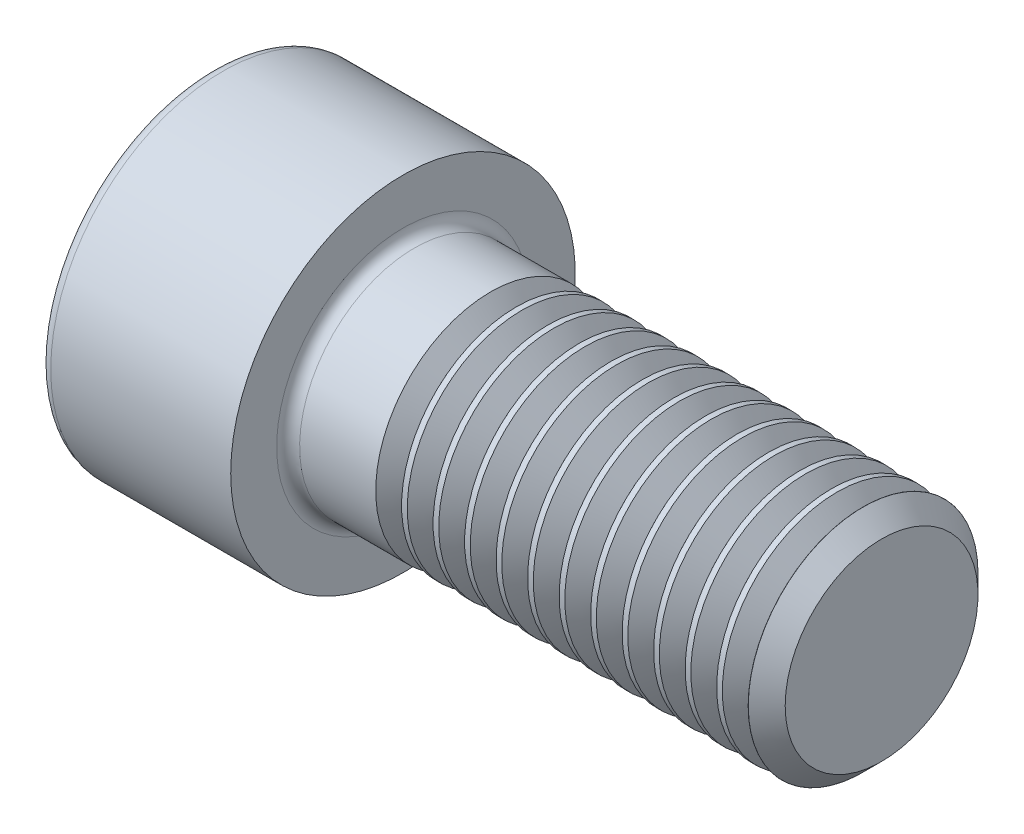
ISO-10303-21;
HEADER;
FILE_DESCRIPTION(('STEP AP214'),'2;1');
FILE_NAME('part.step','',(''),(''),'','','');
FILE_SCHEMA(('AUTOMOTIVE_DESIGN { 1 0 10303 214 1 1 1 1 }'));
ENDSEC;
DATA;
#1=APPLICATION_CONTEXT('core data for automotive mechanical design processes');
#2=APPLICATION_PROTOCOL_DEFINITION('international standard','automotive_design',2000,#1);
#3=PRODUCT_CONTEXT('',#1,'mechanical');
#4=PRODUCT('Part','Part','',(#3));
#5=PRODUCT_RELATED_PRODUCT_CATEGORY('part','',(#4));
#6=PRODUCT_DEFINITION_FORMATION('','',#4);
#7=PRODUCT_DEFINITION_CONTEXT('part definition',#1,'design');
#8=PRODUCT_DEFINITION('design','',#6,#7);
#9=PRODUCT_DEFINITION_SHAPE('','',#8);
#10=(LENGTH_UNIT() NAMED_UNIT(*) SI_UNIT(.MILLI.,.METRE.));
#11=(NAMED_UNIT(*) PLANE_ANGLE_UNIT() SI_UNIT($,.RADIAN.));
#12=(NAMED_UNIT(*) SI_UNIT($,.STERADIAN.) SOLID_ANGLE_UNIT());
#13=UNCERTAINTY_MEASURE_WITH_UNIT(LENGTH_MEASURE(1.E-05),#10,'distance_accuracy_value','');
#14=(GEOMETRIC_REPRESENTATION_CONTEXT(3) GLOBAL_UNCERTAINTY_ASSIGNED_CONTEXT((#13)) GLOBAL_UNIT_ASSIGNED_CONTEXT((#10,
#11,#12)) REPRESENTATION_CONTEXT('',''));
#15=CARTESIAN_POINT('',(0.,0.,0.));
#16=DIRECTION('',(0.,0.,1.));
#17=DIRECTION('',(1.,0.,0.));
#18=AXIS2_PLACEMENT_3D('',#15,#16,#17);
#19=CARTESIAN_POINT('',(0.,0.,0.));
#20=DIRECTION('',(-1.,0.,0.));
#21=DIRECTION('',(0.,0.,1.));
#22=AXIS2_PLACEMENT_3D('',#19,#20,#21);
#23=PLANE('',#22);
#24=DIRECTION('',(0.,-0.499999999999999,0.866025403784439));
#25=VECTOR('',#24,1.);
#26=CARTESIAN_POINT('',(0.,5.83989797285307,0.));
#27=LINE('',#26,#25);
#28=CARTESIAN_POINT('',(0.,5.83989797285307,0.));
#29=VERTEX_POINT('',#28);
#30=CARTESIAN_POINT('',(0.,2.91994898642654,5.0575));
#31=VERTEX_POINT('',#30);
#32=EDGE_CURVE('E448',#29,#31,#27,.T.);
#33=ORIENTED_EDGE('',*,*,#32,.T.);
#34=DIRECTION('',(0.,1.,0.));
#35=VECTOR('',#34,1.);
#36=CARTESIAN_POINT('',(0.,-2.91994898642653,5.0575));
#37=LINE('',#36,#35);
#38=CARTESIAN_POINT('',(0.,-2.91994898642653,5.0575));
#39=VERTEX_POINT('',#38);
#40=EDGE_CURVE('E135',#39,#31,#37,.T.);
#41=ORIENTED_EDGE('',*,*,#40,.F.);
#42=DIRECTION('',(0.,-0.500000000000001,-0.866025403784438));
#43=VECTOR('',#42,1.);
#44=CARTESIAN_POINT('',(0.,-2.91994898642653,5.0575));
#45=LINE('',#44,#43);
#46=CARTESIAN_POINT('',(0.,-5.83989797285306,0.));
#47=VERTEX_POINT('',#46);
#48=EDGE_CURVE('E467',#39,#47,#45,.T.);
#49=ORIENTED_EDGE('',*,*,#48,.T.);
#50=DIRECTION('',(0.,0.499999999999999,-0.866025403784439));
#51=VECTOR('',#50,1.);
#52=CARTESIAN_POINT('',(0.,-5.83989797285306,0.));
#53=LINE('',#52,#51);
#54=CARTESIAN_POINT('',(0.,-2.91994898642654,-5.0575));
#55=VERTEX_POINT('',#54);
#56=EDGE_CURVE('E470',#47,#55,#53,.T.);
#57=ORIENTED_EDGE('',*,*,#56,.T.);
#58=DIRECTION('',(0.,-1.,0.));
#59=VECTOR('',#58,1.);
#60=CARTESIAN_POINT('',(0.,2.91994898642653,-5.0575));
#61=LINE('',#60,#59);
#62=CARTESIAN_POINT('',(0.,2.91994898642653,-5.0575));
#63=VERTEX_POINT('',#62);
#64=EDGE_CURVE('E473',#63,#55,#61,.T.);
#65=ORIENTED_EDGE('',*,*,#64,.F.);
#66=DIRECTION('',(0.,-0.500000000000001,-0.866025403784438));
#67=VECTOR('',#66,1.);
#68=CARTESIAN_POINT('',(0.,5.83989797285307,0.));
#69=LINE('',#68,#67);
#70=EDGE_CURVE('E130',#29,#63,#69,.T.);
#71=ORIENTED_EDGE('',*,*,#70,.F.);
#72=EDGE_LOOP('',(#33,#41,#49,#57,#65,#71));
#73=FACE_BOUND('',#72,.T.);
#74=CARTESIAN_POINT('',(0.,0.,0.));
#75=DIRECTION('',(-1.,0.,0.));
#76=DIRECTION('',(0.,0.,1.));
#77=AXIS2_PLACEMENT_3D('',#74,#75,#76);
#78=CIRCLE('',#77,8.4);
#79=CARTESIAN_POINT('',(0.,0.,8.4));
#80=VERTEX_POINT('',#79);
#81=EDGE_CURVE('E47',#80,#80,#78,.T.);
#82=ORIENTED_EDGE('',*,*,#81,.T.);
#83=EDGE_LOOP('',(#82));
#84=FACE_BOUND('',#83,.T.);
#85=ADVANCED_FACE('F39',(#73,#84),#23,.T.);
#86=CARTESIAN_POINT('',(-31.75,0.,0.));
#87=DIRECTION('',(-1.,0.,0.));
#88=DIRECTION('',(0.,0.,1.));
#89=AXIS2_PLACEMENT_3D('',#86,#87,#88);
#90=CYLINDRICAL_SURFACE('',#89,9.);
#91=CARTESIAN_POINT('',(0.600000000000003,0.,0.));
#92=DIRECTION('',(-1.,0.,0.));
#93=DIRECTION('',(0.,0.,1.));
#94=AXIS2_PLACEMENT_3D('',#91,#92,#93);
#95=CIRCLE('',#94,9.);
#96=CARTESIAN_POINT('',(0.600000000000003,0.,9.));
#97=VERTEX_POINT('',#96);
#98=EDGE_CURVE('E11',#97,#97,#95,.F.);
#99=ORIENTED_EDGE('',*,*,#98,.T.);
#100=EDGE_LOOP('',(#99));
#101=FACE_BOUND('',#100,.T.);
#102=CARTESIAN_POINT('',(9.99999999999999,0.,0.));
#103=DIRECTION('',(-1.,0.,0.));
#104=DIRECTION('',(0.,0.,1.));
#105=AXIS2_PLACEMENT_3D('',#102,#103,#104);
#106=CIRCLE('',#105,9.);
#107=CARTESIAN_POINT('',(9.99999999999999,0.,9.));
#108=VERTEX_POINT('',#107);
#109=EDGE_CURVE('E153',#108,#108,#106,.T.);
#110=ORIENTED_EDGE('',*,*,#109,.T.);
#111=EDGE_LOOP('',(#110));
#112=FACE_BOUND('',#111,.T.);
#113=ADVANCED_FACE('F177',(#101,#112),#90,.T.);
#114=CARTESIAN_POINT('',(10.,9.,0.));
#115=DIRECTION('',(1.,0.,0.));
#116=DIRECTION('',(0.,0.,-1.));
#117=AXIS2_PLACEMENT_3D('',#114,#115,#116);
#118=PLANE('',#117);
#119=CARTESIAN_POINT('',(10.,0.,0.));
#120=DIRECTION('',(1.,0.,0.));
#121=DIRECTION('',(0.,0.,-1.));
#122=AXIS2_PLACEMENT_3D('',#119,#120,#121);
#123=CIRCLE('',#122,6.6);
#124=CARTESIAN_POINT('',(10.,0.,-6.6));
#125=VERTEX_POINT('',#124);
#126=EDGE_CURVE('E156',#125,#125,#123,.F.);
#127=ORIENTED_EDGE('',*,*,#126,.T.);
#128=EDGE_LOOP('',(#127));
#129=FACE_BOUND('',#128,.T.);
#130=ORIENTED_EDGE('',*,*,#109,.F.);
#131=EDGE_LOOP('',(#130));
#132=FACE_BOUND('',#131,.T.);
#133=ADVANCED_FACE('F183',(#129,#132),#118,.T.);
#134=CARTESIAN_POINT('',(-31.75,0.,0.));
#135=DIRECTION('',(-1.,0.,0.));
#136=DIRECTION('',(0.,0.,1.));
#137=AXIS2_PLACEMENT_3D('',#134,#135,#136);
#138=CYLINDRICAL_SURFACE('',#137,6.);
#139=CARTESIAN_POINT('',(14.5749999331658,0.,0.));
#140=DIRECTION('',(-1.,0.,0.));
#141=DIRECTION('',(0.,-1.,0.));
#142=AXIS2_PLACEMENT_3D('',#139,#140,#141);
#143=CIRCLE('',#142,6.);
#144=CARTESIAN_POINT('',(14.5749999331658,-6.,0.));
#145=VERTEX_POINT('',#144);
#146=EDGE_CURVE('E443',#145,#145,#143,.T.);
#147=ORIENTED_EDGE('',*,*,#146,.T.);
#148=EDGE_LOOP('',(#147));
#149=FACE_BOUND('',#148,.T.);
#150=CARTESIAN_POINT('',(10.6,0.,0.));
#151=DIRECTION('',(1.,0.,0.));
#152=DIRECTION('',(0.,0.,-1.));
#153=AXIS2_PLACEMENT_3D('',#150,#151,#152);
#154=CIRCLE('',#153,6.);
#155=CARTESIAN_POINT('',(10.6,0.,-6.));
#156=VERTEX_POINT('',#155);
#157=EDGE_CURVE('E159',#156,#156,#154,.T.);
#158=ORIENTED_EDGE('',*,*,#157,.T.);
#159=EDGE_LOOP('',(#158));
#160=FACE_BOUND('',#159,.T.);
#161=ADVANCED_FACE('F173',(#149,#160),#138,.T.);
#162=CARTESIAN_POINT('',(10.6,0.,0.));
#163=DIRECTION('',(1.,0.,0.));
#164=DIRECTION('',(0.,0.,-1.));
#165=AXIS2_PLACEMENT_3D('',#162,#163,#164);
#166=TOROIDAL_SURFACE('',#165,6.6,0.6);
#167=ORIENTED_EDGE('',*,*,#157,.F.);
#168=EDGE_LOOP('',(#167));
#169=FACE_BOUND('',#168,.T.);
#170=ORIENTED_EDGE('',*,*,#126,.F.);
#171=EDGE_LOOP('',(#170));
#172=FACE_BOUND('',#171,.T.);
#173=ADVANCED_FACE('F166',(#169,#172),#166,.F.);
#174=CARTESIAN_POINT('',(0.600000000000003,0.,0.));
#175=DIRECTION('',(-1.,0.,0.));
#176=DIRECTION('',(0.,0.,1.));
#177=AXIS2_PLACEMENT_3D('',#174,#175,#176);
#178=TOROIDAL_SURFACE('',#177,8.4,0.6);
#179=ORIENTED_EDGE('',*,*,#98,.F.);
#180=EDGE_LOOP('',(#179));
#181=FACE_BOUND('',#180,.T.);
#182=ORIENTED_EDGE('',*,*,#81,.F.);
#183=EDGE_LOOP('',(#182));
#184=FACE_BOUND('',#183,.T.);
#185=ADVANCED_FACE('F41',(#181,#184),#178,.T.);
#186=CARTESIAN_POINT('',(6.,5.83989797285307,0.));
#187=DIRECTION('',(0.,-0.866025403784439,-0.499999999999999));
#188=DIRECTION('',(0.,0.499999999999999,-0.866025403784439));
#189=AXIS2_PLACEMENT_3D('',#186,#187,#188);
#190=PLANE('',#189);
#191=ORIENTED_EDGE('',*,*,#32,.F.);
#192=DIRECTION('',(-1.,0.,0.));
#193=VECTOR('',#192,1.);
#194=CARTESIAN_POINT('',(6.,5.83989797285307,0.));
#195=LINE('',#194,#193);
#196=CARTESIAN_POINT('',(6.,5.83989797285307,0.));
#197=VERTEX_POINT('',#196);
#198=EDGE_CURVE('E464',#197,#29,#195,.T.);
#199=ORIENTED_EDGE('',*,*,#198,.F.);
#200=DIRECTION('',(0.,-0.499999999999999,0.866025403784439));
#201=VECTOR('',#200,1.);
#202=CARTESIAN_POINT('',(6.,5.83989797285307,0.));
#203=LINE('',#202,#201);
#204=CARTESIAN_POINT('',(6.,4.3799234796398,2.52874999999999));
#205=VERTEX_POINT('',#204);
#206=EDGE_CURVE('E122',#197,#205,#203,.T.);
#207=ORIENTED_EDGE('',*,*,#206,.T.);
#208=CARTESIAN_POINT('',(6.,2.91994898642654,5.0575));
#209=VERTEX_POINT('',#208);
#210=EDGE_CURVE('E113',#205,#209,#203,.T.);
#211=ORIENTED_EDGE('',*,*,#210,.T.);
#212=DIRECTION('',(-1.,0.,0.));
#213=VECTOR('',#212,1.);
#214=CARTESIAN_POINT('',(6.,2.91994898642654,5.0575));
#215=LINE('',#214,#213);
#216=EDGE_CURVE('E127',#209,#31,#215,.T.);
#217=ORIENTED_EDGE('',*,*,#216,.T.);
#218=EDGE_LOOP('',(#191,#199,#207,#211,#217));
#219=FACE_BOUND('',#218,.T.);
#220=ADVANCED_FACE('F126',(#219),#190,.T.);
#221=CARTESIAN_POINT('',(6.,-2.91994898642653,5.0575));
#222=DIRECTION('',(0.,0.,1.));
#223=DIRECTION('',(0.,-1.,0.));
#224=AXIS2_PLACEMENT_3D('',#221,#222,#223);
#225=PLANE('',#224);
#226=ORIENTED_EDGE('',*,*,#40,.T.);
#227=ORIENTED_EDGE('',*,*,#216,.F.);
#228=DIRECTION('',(0.,1.,0.));
#229=VECTOR('',#228,1.);
#230=CARTESIAN_POINT('',(6.,-2.91994898642653,5.0575));
#231=LINE('',#230,#229);
#232=CARTESIAN_POINT('',(6.,0.,5.0575));
#233=VERTEX_POINT('',#232);
#234=EDGE_CURVE('E110',#233,#209,#231,.T.);
#235=ORIENTED_EDGE('',*,*,#234,.F.);
#236=CARTESIAN_POINT('',(6.,-2.91994898642653,5.0575));
#237=VERTEX_POINT('',#236);
#238=EDGE_CURVE('E121',#237,#233,#231,.T.);
#239=ORIENTED_EDGE('',*,*,#238,.F.);
#240=DIRECTION('',(-1.,0.,0.));
#241=VECTOR('',#240,1.);
#242=CARTESIAN_POINT('',(6.,-2.91994898642653,5.0575));
#243=LINE('',#242,#241);
#244=EDGE_CURVE('E137',#237,#39,#243,.T.);
#245=ORIENTED_EDGE('',*,*,#244,.T.);
#246=EDGE_LOOP('',(#226,#227,#235,#239,#245));
#247=FACE_BOUND('',#246,.T.);
#248=ADVANCED_FACE('F132',(#247),#225,.F.);
#249=CARTESIAN_POINT('',(6.,-2.91994898642653,5.0575));
#250=DIRECTION('',(0.,0.866025403784438,-0.500000000000001));
#251=DIRECTION('',(0.,0.500000000000001,0.866025403784438));
#252=AXIS2_PLACEMENT_3D('',#249,#250,#251);
#253=PLANE('',#252);
#254=ORIENTED_EDGE('',*,*,#48,.F.);
#255=ORIENTED_EDGE('',*,*,#244,.F.);
#256=DIRECTION('',(0.,-0.500000000000001,-0.866025403784438));
#257=VECTOR('',#256,1.);
#258=CARTESIAN_POINT('',(6.,-2.91994898642653,5.0575));
#259=LINE('',#258,#257);
#260=CARTESIAN_POINT('',(6.,-4.37992347963979,2.52875));
#261=VERTEX_POINT('',#260);
#262=EDGE_CURVE('E451',#237,#261,#259,.T.);
#263=ORIENTED_EDGE('',*,*,#262,.T.);
#264=CARTESIAN_POINT('',(6.,-5.83989797285306,0.));
#265=VERTEX_POINT('',#264);
#266=EDGE_CURVE('E450',#261,#265,#259,.T.);
#267=ORIENTED_EDGE('',*,*,#266,.T.);
#268=DIRECTION('',(-1.,0.,0.));
#269=VECTOR('',#268,1.);
#270=CARTESIAN_POINT('',(6.,-5.83989797285306,0.));
#271=LINE('',#270,#269);
#272=EDGE_CURVE('E142',#265,#47,#271,.T.);
#273=ORIENTED_EDGE('',*,*,#272,.T.);
#274=EDGE_LOOP('',(#254,#255,#263,#267,#273));
#275=FACE_BOUND('',#274,.T.);
#276=ADVANCED_FACE('F211',(#275),#253,.T.);
#277=CARTESIAN_POINT('',(6.,-5.83989797285306,0.));
#278=DIRECTION('',(0.,0.866025403784439,0.499999999999999));
#279=DIRECTION('',(0.,-0.499999999999999,0.866025403784439));
#280=AXIS2_PLACEMENT_3D('',#277,#278,#279);
#281=PLANE('',#280);
#282=ORIENTED_EDGE('',*,*,#56,.F.);
#283=ORIENTED_EDGE('',*,*,#272,.F.);
#284=DIRECTION('',(0.,0.499999999999999,-0.866025403784439));
#285=VECTOR('',#284,1.);
#286=CARTESIAN_POINT('',(6.,-5.83989797285306,0.));
#287=LINE('',#286,#285);
#288=CARTESIAN_POINT('',(6.,-4.3799234796398,-2.52874999999999));
#289=VERTEX_POINT('',#288);
#290=EDGE_CURVE('E455',#265,#289,#287,.T.);
#291=ORIENTED_EDGE('',*,*,#290,.T.);
#292=CARTESIAN_POINT('',(6.,-2.91994898642654,-5.0575));
#293=VERTEX_POINT('',#292);
#294=EDGE_CURVE('E454',#289,#293,#287,.T.);
#295=ORIENTED_EDGE('',*,*,#294,.T.);
#296=DIRECTION('',(-1.,0.,0.));
#297=VECTOR('',#296,1.);
#298=CARTESIAN_POINT('',(6.,-2.91994898642654,-5.0575));
#299=LINE('',#298,#297);
#300=EDGE_CURVE('E482',#293,#55,#299,.T.);
#301=ORIENTED_EDGE('',*,*,#300,.T.);
#302=EDGE_LOOP('',(#282,#283,#291,#295,#301));
#303=FACE_BOUND('',#302,.T.);
#304=ADVANCED_FACE('F214',(#303),#281,.T.);
#305=CARTESIAN_POINT('',(6.,2.91994898642653,-5.0575));
#306=DIRECTION('',(0.,0.,-1.));
#307=DIRECTION('',(0.,1.,0.));
#308=AXIS2_PLACEMENT_3D('',#305,#306,#307);
#309=PLANE('',#308);
#310=ORIENTED_EDGE('',*,*,#64,.T.);
#311=ORIENTED_EDGE('',*,*,#300,.F.);
#312=DIRECTION('',(0.,-1.,0.));
#313=VECTOR('',#312,1.);
#314=CARTESIAN_POINT('',(6.,2.91994898642653,-5.0575));
#315=LINE('',#314,#313);
#316=CARTESIAN_POINT('',(6.,0.,-5.0575));
#317=VERTEX_POINT('',#316);
#318=EDGE_CURVE('E458',#317,#293,#315,.T.);
#319=ORIENTED_EDGE('',*,*,#318,.F.);
#320=CARTESIAN_POINT('',(6.,2.91994898642653,-5.0575));
#321=VERTEX_POINT('',#320);
#322=EDGE_CURVE('E54',#321,#317,#315,.T.);
#323=ORIENTED_EDGE('',*,*,#322,.F.);
#324=DIRECTION('',(-1.,0.,0.));
#325=VECTOR('',#324,1.);
#326=CARTESIAN_POINT('',(6.,2.91994898642653,-5.0575));
#327=LINE('',#326,#325);
#328=EDGE_CURVE('E479',#321,#63,#327,.T.);
#329=ORIENTED_EDGE('',*,*,#328,.T.);
#330=EDGE_LOOP('',(#310,#311,#319,#323,#329));
#331=FACE_BOUND('',#330,.T.);
#332=ADVANCED_FACE('F218',(#331),#309,.F.);
#333=CARTESIAN_POINT('',(6.,5.83989797285307,0.));
#334=DIRECTION('',(0.,0.866025403784438,-0.500000000000001));
#335=DIRECTION('',(0.,0.500000000000001,0.866025403784438));
#336=AXIS2_PLACEMENT_3D('',#333,#334,#335);
#337=PLANE('',#336);
#338=ORIENTED_EDGE('',*,*,#70,.T.);
#339=ORIENTED_EDGE('',*,*,#328,.F.);
#340=DIRECTION('',(0.,-0.500000000000001,-0.866025403784438));
#341=VECTOR('',#340,1.);
#342=CARTESIAN_POINT('',(6.,5.83989797285307,0.));
#343=LINE('',#342,#341);
#344=CARTESIAN_POINT('',(6.,4.3799234796398,-2.52875000000001));
#345=VERTEX_POINT('',#344);
#346=EDGE_CURVE('E460',#345,#321,#343,.T.);
#347=ORIENTED_EDGE('',*,*,#346,.F.);
#348=EDGE_CURVE('E461',#197,#345,#343,.T.);
#349=ORIENTED_EDGE('',*,*,#348,.F.);
#350=ORIENTED_EDGE('',*,*,#198,.T.);
#351=EDGE_LOOP('',(#338,#339,#347,#349,#350));
#352=FACE_BOUND('',#351,.T.);
#353=ADVANCED_FACE('F222',(#352),#337,.F.);
#354=CARTESIAN_POINT('',(6.,8.75984695927959,-5.05750000000001));
#355=DIRECTION('',(1.,0.,0.));
#356=DIRECTION('',(0.,0.,-1.));
#357=AXIS2_PLACEMENT_3D('',#354,#355,#356);
#358=PLANE('',#357);
#359=ORIENTED_EDGE('',*,*,#318,.T.);
#360=ORIENTED_EDGE('',*,*,#294,.F.);
#361=CARTESIAN_POINT('',(6.,0.,0.));
#362=DIRECTION('',(-1.,0.,0.));
#363=DIRECTION('',(0.,0.,1.));
#364=AXIS2_PLACEMENT_3D('',#361,#362,#363);
#365=CIRCLE('',#364,5.0575);
#366=EDGE_CURVE('E499',#317,#289,#365,.T.);
#367=ORIENTED_EDGE('',*,*,#366,.F.);
#368=EDGE_LOOP('',(#359,#360,#367));
#369=FACE_BOUND('',#368,.T.);
#370=ADVANCED_FACE('F226',(#369),#358,.F.);
#371=ORIENTED_EDGE('',*,*,#290,.F.);
#372=ORIENTED_EDGE('',*,*,#266,.F.);
#373=EDGE_CURVE('E140',#289,#261,#365,.T.);
#374=ORIENTED_EDGE('',*,*,#373,.F.);
#375=EDGE_LOOP('',(#371,#372,#374));
#376=FACE_BOUND('',#375,.T.);
#377=ADVANCED_FACE('F230',(#376),#358,.F.);
#378=ORIENTED_EDGE('',*,*,#262,.F.);
#379=ORIENTED_EDGE('',*,*,#238,.T.);
#380=EDGE_CURVE('E136',#261,#233,#365,.T.);
#381=ORIENTED_EDGE('',*,*,#380,.F.);
#382=EDGE_LOOP('',(#378,#379,#381));
#383=FACE_BOUND('',#382,.T.);
#384=ADVANCED_FACE('F508',(#383),#358,.F.);
#385=ORIENTED_EDGE('',*,*,#234,.T.);
#386=ORIENTED_EDGE('',*,*,#210,.F.);
#387=EDGE_CURVE('E116',#233,#205,#365,.T.);
#388=ORIENTED_EDGE('',*,*,#387,.F.);
#389=EDGE_LOOP('',(#385,#386,#388));
#390=FACE_BOUND('',#389,.T.);
#391=ADVANCED_FACE('F112',(#390),#358,.F.);
#392=ORIENTED_EDGE('',*,*,#206,.F.);
#393=ORIENTED_EDGE('',*,*,#348,.T.);
#394=EDGE_CURVE('E147',#205,#345,#365,.T.);
#395=ORIENTED_EDGE('',*,*,#394,.F.);
#396=EDGE_LOOP('',(#392,#393,#395));
#397=FACE_BOUND('',#396,.T.);
#398=ADVANCED_FACE('F494',(#397),#358,.F.);
#399=ORIENTED_EDGE('',*,*,#346,.T.);
#400=ORIENTED_EDGE('',*,*,#322,.T.);
#401=EDGE_CURVE('E498',#345,#317,#365,.T.);
#402=ORIENTED_EDGE('',*,*,#401,.F.);
#403=EDGE_LOOP('',(#399,#400,#402));
#404=FACE_BOUND('',#403,.T.);
#405=ADVANCED_FACE('F207',(#404),#358,.F.);
#406=CARTESIAN_POINT('',(6.,0.,0.));
#407=DIRECTION('',(-1.,0.,0.));
#408=DIRECTION('',(0.,0.,1.));
#409=AXIS2_PLACEMENT_3D('',#406,#407,#408);
#410=CONICAL_SURFACE('',#409,5.0575,1.04719755119659);
#411=CARTESIAN_POINT('',(8.91994898642657,0.,0.));
#412=VERTEX_POINT('',#411);
#413=VERTEX_LOOP('',#412);
#414=FACE_BOUND('',#413,.T.);
#415=ORIENTED_EDGE('',*,*,#387,.T.);
#416=ORIENTED_EDGE('',*,*,#394,.T.);
#417=ORIENTED_EDGE('',*,*,#401,.T.);
#418=ORIENTED_EDGE('',*,*,#366,.T.);
#419=ORIENTED_EDGE('',*,*,#373,.T.);
#420=ORIENTED_EDGE('',*,*,#380,.T.);
#421=EDGE_LOOP('',(#415,#416,#417,#418,#419,#420));
#422=FACE_BOUND('',#421,.T.);
#423=ADVANCED_FACE('F204',(#414,#422),#410,.F.);
#424=CARTESIAN_POINT('',(15.9250000668342,0.,0.));
#425=DIRECTION('',(1.,0.,0.));
#426=DIRECTION('',(0.,1.,0.));
#427=AXIS2_PLACEMENT_3D('',#424,#425,#426);
#428=CONICAL_SURFACE('',#427,6.,0.959931088596884);
#429=CARTESIAN_POINT('',(15.25,0.,0.));
#430=DIRECTION('',(-1.,0.,0.));
#431=DIRECTION('',(0.,-1.,0.));
#432=AXIS2_PLACEMENT_3D('',#429,#430,#431);
#433=CIRCLE('',#432,5.036);
#434=CARTESIAN_POINT('',(15.25,-5.036,0.));
#435=VERTEX_POINT('',#434);
#436=EDGE_CURVE('E440',#435,#435,#433,.T.);
#437=ORIENTED_EDGE('',*,*,#436,.F.);
#438=EDGE_LOOP('',(#437));
#439=FACE_BOUND('',#438,.T.);
#440=CARTESIAN_POINT('',(15.9250000668342,0.,0.));
#441=DIRECTION('',(-1.,0.,0.));
#442=DIRECTION('',(0.,-1.,0.));
#443=AXIS2_PLACEMENT_3D('',#440,#441,#442);
#444=CIRCLE('',#443,6.);
#445=CARTESIAN_POINT('',(15.9250000668342,-6.,0.));
#446=VERTEX_POINT('',#445);
#447=EDGE_CURVE('E446',#446,#446,#444,.T.);
#448=ORIENTED_EDGE('',*,*,#447,.T.);
#449=EDGE_LOOP('',(#448));
#450=FACE_BOUND('',#449,.T.);
#451=ADVANCED_FACE('F206',(#439,#450),#428,.T.);
#452=CARTESIAN_POINT('',(15.25,0.,0.));
#453=DIRECTION('',(-1.,0.,0.));
#454=DIRECTION('',(0.,-1.,0.));
#455=AXIS2_PLACEMENT_3D('',#452,#453,#454);
#456=CONICAL_SURFACE('',#455,5.036,0.959931088596873);
#457=ORIENTED_EDGE('',*,*,#146,.F.);
#458=EDGE_LOOP('',(#457));
#459=FACE_BOUND('',#458,.T.);
#460=ORIENTED_EDGE('',*,*,#436,.T.);
#461=EDGE_LOOP('',(#460));
#462=FACE_BOUND('',#461,.T.);
#463=ADVANCED_FACE('F234',(#459,#462),#456,.T.);
#464=CARTESIAN_POINT('',(16.2208332664992,0.,0.));
#465=DIRECTION('',(-1.,0.,0.));
#466=DIRECTION('',(0.,-1.,0.));
#467=AXIS2_PLACEMENT_3D('',#464,#465,#466);
#468=CIRCLE('',#467,6.);
#469=CARTESIAN_POINT('',(16.2208332664992,-6.,0.));
#470=VERTEX_POINT('',#469);
#471=EDGE_CURVE('E434',#470,#470,#468,.T.);
#472=ORIENTED_EDGE('',*,*,#471,.T.);
#473=EDGE_LOOP('',(#472));
#474=FACE_BOUND('',#473,.T.);
#475=ORIENTED_EDGE('',*,*,#447,.F.);
#476=EDGE_LOOP('',(#475));
#477=FACE_BOUND('',#476,.T.);
#478=ADVANCED_FACE('F194',(#474,#477),#138,.T.);
#479=CARTESIAN_POINT('',(17.5708334001675,0.,0.));
#480=DIRECTION('',(1.,0.,0.));
#481=DIRECTION('',(0.,1.,0.));
#482=AXIS2_PLACEMENT_3D('',#479,#480,#481);
#483=CONICAL_SURFACE('',#482,6.,0.959931088596884);
#484=CARTESIAN_POINT('',(16.8958333333333,0.,0.));
#485=DIRECTION('',(-1.,0.,0.));
#486=DIRECTION('',(0.,-1.,0.));
#487=AXIS2_PLACEMENT_3D('',#484,#485,#486);
#488=CIRCLE('',#487,5.036);
#489=CARTESIAN_POINT('',(16.8958333333333,-5.036,0.));
#490=VERTEX_POINT('',#489);
#491=EDGE_CURVE('E431',#490,#490,#488,.T.);
#492=ORIENTED_EDGE('',*,*,#491,.F.);
#493=EDGE_LOOP('',(#492));
#494=FACE_BOUND('',#493,.T.);
#495=CARTESIAN_POINT('',(17.5708334001675,0.,0.));
#496=DIRECTION('',(-1.,0.,0.));
#497=DIRECTION('',(0.,-1.,0.));
#498=AXIS2_PLACEMENT_3D('',#495,#496,#497);
#499=CIRCLE('',#498,6.);
#500=CARTESIAN_POINT('',(17.5708334001675,-6.,0.));
#501=VERTEX_POINT('',#500);
#502=EDGE_CURVE('E437',#501,#501,#499,.T.);
#503=ORIENTED_EDGE('',*,*,#502,.T.);
#504=EDGE_LOOP('',(#503));
#505=FACE_BOUND('',#504,.T.);
#506=ADVANCED_FACE('F239',(#494,#505),#483,.T.);
#507=CARTESIAN_POINT('',(16.8958333333333,0.,0.));
#508=DIRECTION('',(-1.,0.,0.));
#509=DIRECTION('',(0.,-1.,0.));
#510=AXIS2_PLACEMENT_3D('',#507,#508,#509);
#511=CONICAL_SURFACE('',#510,5.036,0.959931088596873);
#512=ORIENTED_EDGE('',*,*,#471,.F.);
#513=EDGE_LOOP('',(#512));
#514=FACE_BOUND('',#513,.T.);
#515=ORIENTED_EDGE('',*,*,#491,.T.);
#516=EDGE_LOOP('',(#515));
#517=FACE_BOUND('',#516,.T.);
#518=ADVANCED_FACE('F242',(#514,#517),#511,.T.);
#519=CARTESIAN_POINT('',(17.8666665998325,0.,0.));
#520=DIRECTION('',(-1.,0.,0.));
#521=DIRECTION('',(0.,-1.,0.));
#522=AXIS2_PLACEMENT_3D('',#519,#520,#521);
#523=CIRCLE('',#522,6.);
#524=CARTESIAN_POINT('',(17.8666665998325,-6.,0.));
#525=VERTEX_POINT('',#524);
#526=EDGE_CURVE('E425',#525,#525,#523,.T.);
#527=ORIENTED_EDGE('',*,*,#526,.T.);
#528=EDGE_LOOP('',(#527));
#529=FACE_BOUND('',#528,.T.);
#530=ORIENTED_EDGE('',*,*,#502,.F.);
#531=EDGE_LOOP('',(#530));
#532=FACE_BOUND('',#531,.T.);
#533=ADVANCED_FACE('F246',(#529,#532),#138,.T.);
#534=CARTESIAN_POINT('',(19.2166667335008,0.,0.));
#535=DIRECTION('',(1.,0.,0.));
#536=DIRECTION('',(0.,1.,0.));
#537=AXIS2_PLACEMENT_3D('',#534,#535,#536);
#538=CONICAL_SURFACE('',#537,6.,0.959931088596884);
#539=CARTESIAN_POINT('',(18.5416666666667,0.,0.));
#540=DIRECTION('',(-1.,0.,0.));
#541=DIRECTION('',(0.,-1.,0.));
#542=AXIS2_PLACEMENT_3D('',#539,#540,#541);
#543=CIRCLE('',#542,5.036);
#544=CARTESIAN_POINT('',(18.5416666666667,-5.036,0.));
#545=VERTEX_POINT('',#544);
#546=EDGE_CURVE('E422',#545,#545,#543,.T.);
#547=ORIENTED_EDGE('',*,*,#546,.F.);
#548=EDGE_LOOP('',(#547));
#549=FACE_BOUND('',#548,.T.);
#550=CARTESIAN_POINT('',(19.2166667335008,0.,0.));
#551=DIRECTION('',(-1.,0.,0.));
#552=DIRECTION('',(0.,-1.,0.));
#553=AXIS2_PLACEMENT_3D('',#550,#551,#552);
#554=CIRCLE('',#553,6.);
#555=CARTESIAN_POINT('',(19.2166667335008,-6.,0.));
#556=VERTEX_POINT('',#555);
#557=EDGE_CURVE('E428',#556,#556,#554,.T.);
#558=ORIENTED_EDGE('',*,*,#557,.T.);
#559=EDGE_LOOP('',(#558));
#560=FACE_BOUND('',#559,.T.);
#561=ADVANCED_FACE('F248',(#549,#560),#538,.T.);
#562=CARTESIAN_POINT('',(18.5416666666667,0.,0.));
#563=DIRECTION('',(-1.,0.,0.));
#564=DIRECTION('',(0.,-1.,0.));
#565=AXIS2_PLACEMENT_3D('',#562,#563,#564);
#566=CONICAL_SURFACE('',#565,5.036,0.959931088596873);
#567=ORIENTED_EDGE('',*,*,#526,.F.);
#568=EDGE_LOOP('',(#567));
#569=FACE_BOUND('',#568,.T.);
#570=ORIENTED_EDGE('',*,*,#546,.T.);
#571=EDGE_LOOP('',(#570));
#572=FACE_BOUND('',#571,.T.);
#573=ADVANCED_FACE('F251',(#569,#572),#566,.T.);
#574=CARTESIAN_POINT('',(19.5124999331658,0.,0.));
#575=DIRECTION('',(-1.,0.,0.));
#576=DIRECTION('',(0.,-1.,0.));
#577=AXIS2_PLACEMENT_3D('',#574,#575,#576);
#578=CIRCLE('',#577,6.);
#579=CARTESIAN_POINT('',(19.5124999331658,-6.,0.));
#580=VERTEX_POINT('',#579);
#581=EDGE_CURVE('E416',#580,#580,#578,.T.);
#582=ORIENTED_EDGE('',*,*,#581,.T.);
#583=EDGE_LOOP('',(#582));
#584=FACE_BOUND('',#583,.T.);
#585=ORIENTED_EDGE('',*,*,#557,.F.);
#586=EDGE_LOOP('',(#585));
#587=FACE_BOUND('',#586,.T.);
#588=ADVANCED_FACE('F255',(#584,#587),#138,.T.);
#589=CARTESIAN_POINT('',(20.8625000668342,0.,0.));
#590=DIRECTION('',(1.,0.,0.));
#591=DIRECTION('',(0.,1.,0.));
#592=AXIS2_PLACEMENT_3D('',#589,#590,#591);
#593=CONICAL_SURFACE('',#592,6.,0.959931088596884);
#594=CARTESIAN_POINT('',(20.1875,0.,0.));
#595=DIRECTION('',(-1.,0.,0.));
#596=DIRECTION('',(0.,-1.,0.));
#597=AXIS2_PLACEMENT_3D('',#594,#595,#596);
#598=CIRCLE('',#597,5.036);
#599=CARTESIAN_POINT('',(20.1875,-5.036,0.));
#600=VERTEX_POINT('',#599);
#601=EDGE_CURVE('E413',#600,#600,#598,.T.);
#602=ORIENTED_EDGE('',*,*,#601,.F.);
#603=EDGE_LOOP('',(#602));
#604=FACE_BOUND('',#603,.T.);
#605=CARTESIAN_POINT('',(20.8625000668342,0.,0.));
#606=DIRECTION('',(-1.,0.,0.));
#607=DIRECTION('',(0.,-1.,0.));
#608=AXIS2_PLACEMENT_3D('',#605,#606,#607);
#609=CIRCLE('',#608,6.);
#610=CARTESIAN_POINT('',(20.8625000668342,-6.,0.));
#611=VERTEX_POINT('',#610);
#612=EDGE_CURVE('E419',#611,#611,#609,.T.);
#613=ORIENTED_EDGE('',*,*,#612,.T.);
#614=EDGE_LOOP('',(#613));
#615=FACE_BOUND('',#614,.T.);
#616=ADVANCED_FACE('F257',(#604,#615),#593,.T.);
#617=CARTESIAN_POINT('',(20.1875,0.,0.));
#618=DIRECTION('',(-1.,0.,0.));
#619=DIRECTION('',(0.,-1.,0.));
#620=AXIS2_PLACEMENT_3D('',#617,#618,#619);
#621=CONICAL_SURFACE('',#620,5.036,0.959931088596873);
#622=ORIENTED_EDGE('',*,*,#581,.F.);
#623=EDGE_LOOP('',(#622));
#624=FACE_BOUND('',#623,.T.);
#625=ORIENTED_EDGE('',*,*,#601,.T.);
#626=EDGE_LOOP('',(#625));
#627=FACE_BOUND('',#626,.T.);
#628=ADVANCED_FACE('F260',(#624,#627),#621,.T.);
#629=CARTESIAN_POINT('',(21.1583332664992,0.,0.));
#630=DIRECTION('',(-1.,0.,0.));
#631=DIRECTION('',(0.,-1.,0.));
#632=AXIS2_PLACEMENT_3D('',#629,#630,#631);
#633=CIRCLE('',#632,6.);
#634=CARTESIAN_POINT('',(21.1583332664992,-6.,0.));
#635=VERTEX_POINT('',#634);
#636=EDGE_CURVE('E407',#635,#635,#633,.T.);
#637=ORIENTED_EDGE('',*,*,#636,.T.);
#638=EDGE_LOOP('',(#637));
#639=FACE_BOUND('',#638,.T.);
#640=ORIENTED_EDGE('',*,*,#612,.F.);
#641=EDGE_LOOP('',(#640));
#642=FACE_BOUND('',#641,.T.);
#643=ADVANCED_FACE('F264',(#639,#642),#138,.T.);
#644=CARTESIAN_POINT('',(22.5083334001675,0.,0.));
#645=DIRECTION('',(1.,0.,0.));
#646=DIRECTION('',(0.,1.,0.));
#647=AXIS2_PLACEMENT_3D('',#644,#645,#646);
#648=CONICAL_SURFACE('',#647,6.,0.959931088596884);
#649=CARTESIAN_POINT('',(21.8333333333333,0.,0.));
#650=DIRECTION('',(-1.,0.,0.));
#651=DIRECTION('',(0.,-1.,0.));
#652=AXIS2_PLACEMENT_3D('',#649,#650,#651);
#653=CIRCLE('',#652,5.036);
#654=CARTESIAN_POINT('',(21.8333333333333,-5.036,0.));
#655=VERTEX_POINT('',#654);
#656=EDGE_CURVE('E404',#655,#655,#653,.T.);
#657=ORIENTED_EDGE('',*,*,#656,.F.);
#658=EDGE_LOOP('',(#657));
#659=FACE_BOUND('',#658,.T.);
#660=CARTESIAN_POINT('',(22.5083334001675,0.,0.));
#661=DIRECTION('',(-1.,0.,0.));
#662=DIRECTION('',(0.,-1.,0.));
#663=AXIS2_PLACEMENT_3D('',#660,#661,#662);
#664=CIRCLE('',#663,6.);
#665=CARTESIAN_POINT('',(22.5083334001675,-6.,0.));
#666=VERTEX_POINT('',#665);
#667=EDGE_CURVE('E410',#666,#666,#664,.T.);
#668=ORIENTED_EDGE('',*,*,#667,.T.);
#669=EDGE_LOOP('',(#668));
#670=FACE_BOUND('',#669,.T.);
#671=ADVANCED_FACE('F266',(#659,#670),#648,.T.);
#672=CARTESIAN_POINT('',(21.8333333333333,0.,0.));
#673=DIRECTION('',(-1.,0.,0.));
#674=DIRECTION('',(0.,-1.,0.));
#675=AXIS2_PLACEMENT_3D('',#672,#673,#674);
#676=CONICAL_SURFACE('',#675,5.036,0.959931088596873);
#677=ORIENTED_EDGE('',*,*,#636,.F.);
#678=EDGE_LOOP('',(#677));
#679=FACE_BOUND('',#678,.T.);
#680=ORIENTED_EDGE('',*,*,#656,.T.);
#681=EDGE_LOOP('',(#680));
#682=FACE_BOUND('',#681,.T.);
#683=ADVANCED_FACE('F269',(#679,#682),#676,.T.);
#684=CARTESIAN_POINT('',(22.8041665998325,0.,0.));
#685=DIRECTION('',(-1.,0.,0.));
#686=DIRECTION('',(0.,-1.,0.));
#687=AXIS2_PLACEMENT_3D('',#684,#685,#686);
#688=CIRCLE('',#687,6.);
#689=CARTESIAN_POINT('',(22.8041665998325,-6.,0.));
#690=VERTEX_POINT('',#689);
#691=EDGE_CURVE('E398',#690,#690,#688,.T.);
#692=ORIENTED_EDGE('',*,*,#691,.T.);
#693=EDGE_LOOP('',(#692));
#694=FACE_BOUND('',#693,.T.);
#695=ORIENTED_EDGE('',*,*,#667,.F.);
#696=EDGE_LOOP('',(#695));
#697=FACE_BOUND('',#696,.T.);
#698=ADVANCED_FACE('F273',(#694,#697),#138,.T.);
#699=CARTESIAN_POINT('',(24.1541667335008,0.,0.));
#700=DIRECTION('',(1.,0.,0.));
#701=DIRECTION('',(0.,1.,0.));
#702=AXIS2_PLACEMENT_3D('',#699,#700,#701);
#703=CONICAL_SURFACE('',#702,6.,0.959931088596884);
#704=CARTESIAN_POINT('',(23.4791666666667,0.,0.));
#705=DIRECTION('',(-1.,0.,0.));
#706=DIRECTION('',(0.,-1.,0.));
#707=AXIS2_PLACEMENT_3D('',#704,#705,#706);
#708=CIRCLE('',#707,5.036);
#709=CARTESIAN_POINT('',(23.4791666666667,-5.036,0.));
#710=VERTEX_POINT('',#709);
#711=EDGE_CURVE('E395',#710,#710,#708,.T.);
#712=ORIENTED_EDGE('',*,*,#711,.F.);
#713=EDGE_LOOP('',(#712));
#714=FACE_BOUND('',#713,.T.);
#715=CARTESIAN_POINT('',(24.1541667335008,0.,0.));
#716=DIRECTION('',(-1.,0.,0.));
#717=DIRECTION('',(0.,-1.,0.));
#718=AXIS2_PLACEMENT_3D('',#715,#716,#717);
#719=CIRCLE('',#718,6.);
#720=CARTESIAN_POINT('',(24.1541667335008,-6.,0.));
#721=VERTEX_POINT('',#720);
#722=EDGE_CURVE('E401',#721,#721,#719,.T.);
#723=ORIENTED_EDGE('',*,*,#722,.T.);
#724=EDGE_LOOP('',(#723));
#725=FACE_BOUND('',#724,.T.);
#726=ADVANCED_FACE('F275',(#714,#725),#703,.T.);
#727=CARTESIAN_POINT('',(23.4791666666667,0.,0.));
#728=DIRECTION('',(-1.,0.,0.));
#729=DIRECTION('',(0.,-1.,0.));
#730=AXIS2_PLACEMENT_3D('',#727,#728,#729);
#731=CONICAL_SURFACE('',#730,5.036,0.959931088596873);
#732=ORIENTED_EDGE('',*,*,#691,.F.);
#733=EDGE_LOOP('',(#732));
#734=FACE_BOUND('',#733,.T.);
#735=ORIENTED_EDGE('',*,*,#711,.T.);
#736=EDGE_LOOP('',(#735));
#737=FACE_BOUND('',#736,.T.);
#738=ADVANCED_FACE('F278',(#734,#737),#731,.T.);
#739=CARTESIAN_POINT('',(24.4499999331658,0.,0.));
#740=DIRECTION('',(-1.,0.,0.));
#741=DIRECTION('',(0.,-1.,0.));
#742=AXIS2_PLACEMENT_3D('',#739,#740,#741);
#743=CIRCLE('',#742,6.);
#744=CARTESIAN_POINT('',(24.4499999331658,-6.,0.));
#745=VERTEX_POINT('',#744);
#746=EDGE_CURVE('E389',#745,#745,#743,.T.);
#747=ORIENTED_EDGE('',*,*,#746,.T.);
#748=EDGE_LOOP('',(#747));
#749=FACE_BOUND('',#748,.T.);
#750=ORIENTED_EDGE('',*,*,#722,.F.);
#751=EDGE_LOOP('',(#750));
#752=FACE_BOUND('',#751,.T.);
#753=ADVANCED_FACE('F282',(#749,#752),#138,.T.);
#754=CARTESIAN_POINT('',(25.8000000668342,0.,0.));
#755=DIRECTION('',(1.,0.,0.));
#756=DIRECTION('',(0.,1.,0.));
#757=AXIS2_PLACEMENT_3D('',#754,#755,#756);
#758=CONICAL_SURFACE('',#757,6.,0.959931088596884);
#759=CARTESIAN_POINT('',(25.125,0.,0.));
#760=DIRECTION('',(-1.,0.,0.));
#761=DIRECTION('',(0.,-1.,0.));
#762=AXIS2_PLACEMENT_3D('',#759,#760,#761);
#763=CIRCLE('',#762,5.036);
#764=CARTESIAN_POINT('',(25.125,-5.036,0.));
#765=VERTEX_POINT('',#764);
#766=EDGE_CURVE('E386',#765,#765,#763,.T.);
#767=ORIENTED_EDGE('',*,*,#766,.F.);
#768=EDGE_LOOP('',(#767));
#769=FACE_BOUND('',#768,.T.);
#770=CARTESIAN_POINT('',(25.8000000668342,0.,0.));
#771=DIRECTION('',(-1.,0.,0.));
#772=DIRECTION('',(0.,-1.,0.));
#773=AXIS2_PLACEMENT_3D('',#770,#771,#772);
#774=CIRCLE('',#773,6.);
#775=CARTESIAN_POINT('',(25.8000000668342,-6.,0.));
#776=VERTEX_POINT('',#775);
#777=EDGE_CURVE('E392',#776,#776,#774,.T.);
#778=ORIENTED_EDGE('',*,*,#777,.T.);
#779=EDGE_LOOP('',(#778));
#780=FACE_BOUND('',#779,.T.);
#781=ADVANCED_FACE('F284',(#769,#780),#758,.T.);
#782=CARTESIAN_POINT('',(25.125,0.,0.));
#783=DIRECTION('',(-1.,0.,0.));
#784=DIRECTION('',(0.,-1.,0.));
#785=AXIS2_PLACEMENT_3D('',#782,#783,#784);
#786=CONICAL_SURFACE('',#785,5.036,0.959931088596873);
#787=ORIENTED_EDGE('',*,*,#746,.F.);
#788=EDGE_LOOP('',(#787));
#789=FACE_BOUND('',#788,.T.);
#790=ORIENTED_EDGE('',*,*,#766,.T.);
#791=EDGE_LOOP('',(#790));
#792=FACE_BOUND('',#791,.T.);
#793=ADVANCED_FACE('F287',(#789,#792),#786,.T.);
#794=CARTESIAN_POINT('',(26.0958332664992,0.,0.));
#795=DIRECTION('',(-1.,0.,0.));
#796=DIRECTION('',(0.,-1.,0.));
#797=AXIS2_PLACEMENT_3D('',#794,#795,#796);
#798=CIRCLE('',#797,6.);
#799=CARTESIAN_POINT('',(26.0958332664992,-6.,0.));
#800=VERTEX_POINT('',#799);
#801=EDGE_CURVE('E380',#800,#800,#798,.T.);
#802=ORIENTED_EDGE('',*,*,#801,.T.);
#803=EDGE_LOOP('',(#802));
#804=FACE_BOUND('',#803,.T.);
#805=ORIENTED_EDGE('',*,*,#777,.F.);
#806=EDGE_LOOP('',(#805));
#807=FACE_BOUND('',#806,.T.);
#808=ADVANCED_FACE('F291',(#804,#807),#138,.T.);
#809=CARTESIAN_POINT('',(27.4458334001675,0.,0.));
#810=DIRECTION('',(1.,0.,0.));
#811=DIRECTION('',(0.,1.,0.));
#812=AXIS2_PLACEMENT_3D('',#809,#810,#811);
#813=CONICAL_SURFACE('',#812,6.,0.959931088596884);
#814=CARTESIAN_POINT('',(26.7708333333333,0.,0.));
#815=DIRECTION('',(-1.,0.,0.));
#816=DIRECTION('',(0.,-1.,0.));
#817=AXIS2_PLACEMENT_3D('',#814,#815,#816);
#818=CIRCLE('',#817,5.036);
#819=CARTESIAN_POINT('',(26.7708333333333,-5.036,0.));
#820=VERTEX_POINT('',#819);
#821=EDGE_CURVE('E377',#820,#820,#818,.T.);
#822=ORIENTED_EDGE('',*,*,#821,.F.);
#823=EDGE_LOOP('',(#822));
#824=FACE_BOUND('',#823,.T.);
#825=CARTESIAN_POINT('',(27.4458334001675,0.,0.));
#826=DIRECTION('',(-1.,0.,0.));
#827=DIRECTION('',(0.,-1.,0.));
#828=AXIS2_PLACEMENT_3D('',#825,#826,#827);
#829=CIRCLE('',#828,6.);
#830=CARTESIAN_POINT('',(27.4458334001675,-6.,0.));
#831=VERTEX_POINT('',#830);
#832=EDGE_CURVE('E383',#831,#831,#829,.T.);
#833=ORIENTED_EDGE('',*,*,#832,.T.);
#834=EDGE_LOOP('',(#833));
#835=FACE_BOUND('',#834,.T.);
#836=ADVANCED_FACE('F293',(#824,#835),#813,.T.);
#837=CARTESIAN_POINT('',(26.7708333333333,0.,0.));
#838=DIRECTION('',(-1.,0.,0.));
#839=DIRECTION('',(0.,-1.,0.));
#840=AXIS2_PLACEMENT_3D('',#837,#838,#839);
#841=CONICAL_SURFACE('',#840,5.036,0.959931088596873);
#842=ORIENTED_EDGE('',*,*,#801,.F.);
#843=EDGE_LOOP('',(#842));
#844=FACE_BOUND('',#843,.T.);
#845=ORIENTED_EDGE('',*,*,#821,.T.);
#846=EDGE_LOOP('',(#845));
#847=FACE_BOUND('',#846,.T.);
#848=ADVANCED_FACE('F296',(#844,#847),#841,.T.);
#849=CARTESIAN_POINT('',(27.7416665998325,0.,0.));
#850=DIRECTION('',(-1.,0.,0.));
#851=DIRECTION('',(0.,-1.,0.));
#852=AXIS2_PLACEMENT_3D('',#849,#850,#851);
#853=CIRCLE('',#852,6.);
#854=CARTESIAN_POINT('',(27.7416665998325,-6.,0.));
#855=VERTEX_POINT('',#854);
#856=EDGE_CURVE('E371',#855,#855,#853,.T.);
#857=ORIENTED_EDGE('',*,*,#856,.T.);
#858=EDGE_LOOP('',(#857));
#859=FACE_BOUND('',#858,.T.);
#860=ORIENTED_EDGE('',*,*,#832,.F.);
#861=EDGE_LOOP('',(#860));
#862=FACE_BOUND('',#861,.T.);
#863=ADVANCED_FACE('F300',(#859,#862),#138,.T.);
#864=CARTESIAN_POINT('',(29.0916667335008,0.,0.));
#865=DIRECTION('',(1.,0.,0.));
#866=DIRECTION('',(0.,1.,0.));
#867=AXIS2_PLACEMENT_3D('',#864,#865,#866);
#868=CONICAL_SURFACE('',#867,6.,0.959931088596884);
#869=CARTESIAN_POINT('',(28.4166666666667,0.,0.));
#870=DIRECTION('',(-1.,0.,0.));
#871=DIRECTION('',(0.,-1.,0.));
#872=AXIS2_PLACEMENT_3D('',#869,#870,#871);
#873=CIRCLE('',#872,5.036);
#874=CARTESIAN_POINT('',(28.4166666666667,-5.036,0.));
#875=VERTEX_POINT('',#874);
#876=EDGE_CURVE('E368',#875,#875,#873,.T.);
#877=ORIENTED_EDGE('',*,*,#876,.F.);
#878=EDGE_LOOP('',(#877));
#879=FACE_BOUND('',#878,.T.);
#880=CARTESIAN_POINT('',(29.0916667335008,0.,0.));
#881=DIRECTION('',(-1.,0.,0.));
#882=DIRECTION('',(0.,-1.,0.));
#883=AXIS2_PLACEMENT_3D('',#880,#881,#882);
#884=CIRCLE('',#883,6.);
#885=CARTESIAN_POINT('',(29.0916667335008,-6.,0.));
#886=VERTEX_POINT('',#885);
#887=EDGE_CURVE('E374',#886,#886,#884,.T.);
#888=ORIENTED_EDGE('',*,*,#887,.T.);
#889=EDGE_LOOP('',(#888));
#890=FACE_BOUND('',#889,.T.);
#891=ADVANCED_FACE('F302',(#879,#890),#868,.T.);
#892=CARTESIAN_POINT('',(28.4166666666667,0.,0.));
#893=DIRECTION('',(-1.,0.,0.));
#894=DIRECTION('',(0.,-1.,0.));
#895=AXIS2_PLACEMENT_3D('',#892,#893,#894);
#896=CONICAL_SURFACE('',#895,5.036,0.959931088596873);
#897=ORIENTED_EDGE('',*,*,#856,.F.);
#898=EDGE_LOOP('',(#897));
#899=FACE_BOUND('',#898,.T.);
#900=ORIENTED_EDGE('',*,*,#876,.T.);
#901=EDGE_LOOP('',(#900));
#902=FACE_BOUND('',#901,.T.);
#903=ADVANCED_FACE('F305',(#899,#902),#896,.T.);
#904=CARTESIAN_POINT('',(29.3874999331658,0.,0.));
#905=DIRECTION('',(-1.,0.,0.));
#906=DIRECTION('',(0.,-1.,0.));
#907=AXIS2_PLACEMENT_3D('',#904,#905,#906);
#908=CIRCLE('',#907,6.);
#909=CARTESIAN_POINT('',(29.3874999331658,-6.,0.));
#910=VERTEX_POINT('',#909);
#911=EDGE_CURVE('E362',#910,#910,#908,.T.);
#912=ORIENTED_EDGE('',*,*,#911,.T.);
#913=EDGE_LOOP('',(#912));
#914=FACE_BOUND('',#913,.T.);
#915=ORIENTED_EDGE('',*,*,#887,.F.);
#916=EDGE_LOOP('',(#915));
#917=FACE_BOUND('',#916,.T.);
#918=ADVANCED_FACE('F309',(#914,#917),#138,.T.);
#919=CARTESIAN_POINT('',(30.7375000668342,0.,0.));
#920=DIRECTION('',(1.,0.,0.));
#921=DIRECTION('',(0.,1.,0.));
#922=AXIS2_PLACEMENT_3D('',#919,#920,#921);
#923=CONICAL_SURFACE('',#922,6.,0.959931088596884);
#924=CARTESIAN_POINT('',(30.0625,0.,0.));
#925=DIRECTION('',(-1.,0.,0.));
#926=DIRECTION('',(0.,-1.,0.));
#927=AXIS2_PLACEMENT_3D('',#924,#925,#926);
#928=CIRCLE('',#927,5.036);
#929=CARTESIAN_POINT('',(30.0625,-5.036,0.));
#930=VERTEX_POINT('',#929);
#931=EDGE_CURVE('E359',#930,#930,#928,.T.);
#932=ORIENTED_EDGE('',*,*,#931,.F.);
#933=EDGE_LOOP('',(#932));
#934=FACE_BOUND('',#933,.T.);
#935=CARTESIAN_POINT('',(30.7375000668342,0.,0.));
#936=DIRECTION('',(-1.,0.,0.));
#937=DIRECTION('',(0.,-1.,0.));
#938=AXIS2_PLACEMENT_3D('',#935,#936,#937);
#939=CIRCLE('',#938,6.);
#940=CARTESIAN_POINT('',(30.7375000668342,-6.,0.));
#941=VERTEX_POINT('',#940);
#942=EDGE_CURVE('E365',#941,#941,#939,.T.);
#943=ORIENTED_EDGE('',*,*,#942,.T.);
#944=EDGE_LOOP('',(#943));
#945=FACE_BOUND('',#944,.T.);
#946=ADVANCED_FACE('F311',(#934,#945),#923,.T.);
#947=CARTESIAN_POINT('',(30.0625,0.,0.));
#948=DIRECTION('',(-1.,0.,0.));
#949=DIRECTION('',(0.,-1.,0.));
#950=AXIS2_PLACEMENT_3D('',#947,#948,#949);
#951=CONICAL_SURFACE('',#950,5.036,0.959931088596873);
#952=ORIENTED_EDGE('',*,*,#911,.F.);
#953=EDGE_LOOP('',(#952));
#954=FACE_BOUND('',#953,.T.);
#955=ORIENTED_EDGE('',*,*,#931,.T.);
#956=EDGE_LOOP('',(#955));
#957=FACE_BOUND('',#956,.T.);
#958=ADVANCED_FACE('F314',(#954,#957),#951,.T.);
#959=CARTESIAN_POINT('',(31.0333332664992,0.,0.));
#960=DIRECTION('',(-1.,0.,0.));
#961=DIRECTION('',(0.,-1.,0.));
#962=AXIS2_PLACEMENT_3D('',#959,#960,#961);
#963=CIRCLE('',#962,6.);
#964=CARTESIAN_POINT('',(31.0333332664992,-6.,0.));
#965=VERTEX_POINT('',#964);
#966=EDGE_CURVE('E353',#965,#965,#963,.T.);
#967=ORIENTED_EDGE('',*,*,#966,.T.);
#968=EDGE_LOOP('',(#967));
#969=FACE_BOUND('',#968,.T.);
#970=ORIENTED_EDGE('',*,*,#942,.F.);
#971=EDGE_LOOP('',(#970));
#972=FACE_BOUND('',#971,.T.);
#973=ADVANCED_FACE('F318',(#969,#972),#138,.T.);
#974=CARTESIAN_POINT('',(32.3833334001675,0.,0.));
#975=DIRECTION('',(1.,0.,0.));
#976=DIRECTION('',(0.,1.,0.));
#977=AXIS2_PLACEMENT_3D('',#974,#975,#976);
#978=CONICAL_SURFACE('',#977,6.,0.959931088596884);
#979=CARTESIAN_POINT('',(31.7083333333333,0.,0.));
#980=DIRECTION('',(-1.,0.,0.));
#981=DIRECTION('',(0.,-1.,0.));
#982=AXIS2_PLACEMENT_3D('',#979,#980,#981);
#983=CIRCLE('',#982,5.036);
#984=CARTESIAN_POINT('',(31.7083333333333,-5.036,0.));
#985=VERTEX_POINT('',#984);
#986=EDGE_CURVE('E350',#985,#985,#983,.T.);
#987=ORIENTED_EDGE('',*,*,#986,.F.);
#988=EDGE_LOOP('',(#987));
#989=FACE_BOUND('',#988,.T.);
#990=CARTESIAN_POINT('',(32.3833334001675,0.,0.));
#991=DIRECTION('',(-1.,0.,0.));
#992=DIRECTION('',(0.,-1.,0.));
#993=AXIS2_PLACEMENT_3D('',#990,#991,#992);
#994=CIRCLE('',#993,6.);
#995=CARTESIAN_POINT('',(32.3833334001675,-6.,0.));
#996=VERTEX_POINT('',#995);
#997=EDGE_CURVE('E356',#996,#996,#994,.T.);
#998=ORIENTED_EDGE('',*,*,#997,.T.);
#999=EDGE_LOOP('',(#998));
#1000=FACE_BOUND('',#999,.T.);
#1001=ADVANCED_FACE('F320',(#989,#1000),#978,.T.);
#1002=CARTESIAN_POINT('',(31.7083333333333,0.,0.));
#1003=DIRECTION('',(-1.,0.,0.));
#1004=DIRECTION('',(0.,-1.,0.));
#1005=AXIS2_PLACEMENT_3D('',#1002,#1003,#1004);
#1006=CONICAL_SURFACE('',#1005,5.036,0.959931088596873);
#1007=ORIENTED_EDGE('',*,*,#966,.F.);
#1008=EDGE_LOOP('',(#1007));
#1009=FACE_BOUND('',#1008,.T.);
#1010=ORIENTED_EDGE('',*,*,#986,.T.);
#1011=EDGE_LOOP('',(#1010));
#1012=FACE_BOUND('',#1011,.T.);
#1013=ADVANCED_FACE('F323',(#1009,#1012),#1006,.T.);
#1014=CARTESIAN_POINT('',(32.6791665998325,0.,0.));
#1015=DIRECTION('',(-1.,0.,0.));
#1016=DIRECTION('',(0.,-1.,0.));
#1017=AXIS2_PLACEMENT_3D('',#1014,#1015,#1016);
#1018=CIRCLE('',#1017,6.);
#1019=CARTESIAN_POINT('',(32.6791665998325,-6.,0.));
#1020=VERTEX_POINT('',#1019);
#1021=EDGE_CURVE('E340',#1020,#1020,#1018,.T.);
#1022=ORIENTED_EDGE('',*,*,#1021,.T.);
#1023=EDGE_LOOP('',(#1022));
#1024=FACE_BOUND('',#1023,.T.);
#1025=ORIENTED_EDGE('',*,*,#997,.F.);
#1026=EDGE_LOOP('',(#1025));
#1027=FACE_BOUND('',#1026,.T.);
#1028=ADVANCED_FACE('F327',(#1024,#1027),#138,.T.);
#1029=CARTESIAN_POINT('',(34.0291667335008,0.,0.));
#1030=DIRECTION('',(1.,0.,0.));
#1031=DIRECTION('',(0.,1.,0.));
#1032=AXIS2_PLACEMENT_3D('',#1029,#1030,#1031);
#1033=CONICAL_SURFACE('',#1032,6.,0.959931088596884);
#1034=CARTESIAN_POINT('',(33.3541666666667,0.,0.));
#1035=DIRECTION('',(-1.,0.,0.));
#1036=DIRECTION('',(0.,-1.,0.));
#1037=AXIS2_PLACEMENT_3D('',#1034,#1035,#1036);
#1038=CIRCLE('',#1037,5.036);
#1039=CARTESIAN_POINT('',(33.3541666666667,-5.036,0.));
#1040=VERTEX_POINT('',#1039);
#1041=EDGE_CURVE('E343',#1040,#1040,#1038,.T.);
#1042=ORIENTED_EDGE('',*,*,#1041,.F.);
#1043=EDGE_LOOP('',(#1042));
#1044=FACE_BOUND('',#1043,.T.);
#1045=CARTESIAN_POINT('',(34.0291667335008,0.,0.));
#1046=DIRECTION('',(-1.,0.,0.));
#1047=DIRECTION('',(0.,-1.,0.));
#1048=AXIS2_PLACEMENT_3D('',#1045,#1046,#1047);
#1049=CIRCLE('',#1048,6.);
#1050=CARTESIAN_POINT('',(34.0291667335008,-6.,0.));
#1051=VERTEX_POINT('',#1050);
#1052=EDGE_CURVE('E345',#1051,#1051,#1049,.T.);
#1053=ORIENTED_EDGE('',*,*,#1052,.T.);
#1054=EDGE_LOOP('',(#1053));
#1055=FACE_BOUND('',#1054,.T.);
#1056=ADVANCED_FACE('F329',(#1044,#1055),#1033,.T.);
#1057=CARTESIAN_POINT('',(33.3541666666667,0.,0.));
#1058=DIRECTION('',(-1.,0.,0.));
#1059=DIRECTION('',(0.,-1.,0.));
#1060=AXIS2_PLACEMENT_3D('',#1057,#1058,#1059);
#1061=CONICAL_SURFACE('',#1060,5.036,0.959931088596873);
#1062=ORIENTED_EDGE('',*,*,#1021,.F.);
#1063=EDGE_LOOP('',(#1062));
#1064=FACE_BOUND('',#1063,.T.);
#1065=ORIENTED_EDGE('',*,*,#1041,.T.);
#1066=EDGE_LOOP('',(#1065));
#1067=FACE_BOUND('',#1066,.T.);
#1068=ADVANCED_FACE('F202',(#1064,#1067),#1061,.T.);
#1069=CARTESIAN_POINT('',(35.,5.036,0.));
#1070=DIRECTION('',(1.,0.,0.));
#1071=DIRECTION('',(0.,0.,-1.));
#1072=AXIS2_PLACEMENT_3D('',#1069,#1070,#1071);
#1073=PLANE('',#1072);
#1074=CARTESIAN_POINT('',(35.,0.,0.));
#1075=DIRECTION('',(-1.,0.,0.));
#1076=DIRECTION('',(0.,0.,1.));
#1077=AXIS2_PLACEMENT_3D('',#1074,#1075,#1076);
#1078=CIRCLE('',#1077,5.036);
#1079=CARTESIAN_POINT('',(35.,0.,5.036));
#1080=VERTEX_POINT('',#1079);
#1081=EDGE_CURVE('E146',#1080,#1080,#1078,.T.);
#1082=ORIENTED_EDGE('',*,*,#1081,.F.);
#1083=EDGE_LOOP('',(#1082));
#1084=FACE_BOUND('',#1083,.T.);
#1085=ADVANCED_FACE('F198',(#1084),#1073,.T.);
#1086=CARTESIAN_POINT('',(35.,0.,0.));
#1087=DIRECTION('',(-1.,0.,0.));
#1088=DIRECTION('',(0.,0.,1.));
#1089=AXIS2_PLACEMENT_3D('',#1086,#1087,#1088);
#1090=CONICAL_SURFACE('',#1089,5.036,0.785398163397475);
#1091=CARTESIAN_POINT('',(34.0360000000001,0.,0.));
#1092=DIRECTION('',(-1.,0.,0.));
#1093=DIRECTION('',(0.,0.,1.));
#1094=AXIS2_PLACEMENT_3D('',#1091,#1092,#1093);
#1095=CIRCLE('',#1094,6.);
#1096=CARTESIAN_POINT('',(34.0360000000001,0.,6.));
#1097=VERTEX_POINT('',#1096);
#1098=EDGE_CURVE('E150',#1097,#1097,#1095,.T.);
#1099=ORIENTED_EDGE('',*,*,#1098,.F.);
#1100=EDGE_LOOP('',(#1099));
#1101=FACE_BOUND('',#1100,.T.);
#1102=ORIENTED_EDGE('',*,*,#1081,.T.);
#1103=EDGE_LOOP('',(#1102));
#1104=FACE_BOUND('',#1103,.T.);
#1105=ADVANCED_FACE('F195',(#1101,#1104),#1090,.T.);
#1106=ORIENTED_EDGE('',*,*,#1052,.F.);
#1107=EDGE_LOOP('',(#1106));
#1108=FACE_BOUND('',#1107,.T.);
#1109=ORIENTED_EDGE('',*,*,#1098,.T.);
#1110=EDGE_LOOP('',(#1109));
#1111=FACE_BOUND('',#1110,.T.);
#1112=ADVANCED_FACE('F193',(#1108,#1111),#138,.T.);
#1113=CLOSED_SHELL('',(#85,#113,#133,#161,#173,#185,#220,#248,#276,#304,#332,#353,#370,#377,
#384,#391,#398,#405,#423,#451,#463,#478,#506,#518,#533,#561,#573,#588,#616,#628,#643,#671,#683,
#698,#726,#738,#753,#781,#793,#808,#836,#848,#863,#891,#903,#918,#946,#958,#973,#1001,#1013,
#1028,#1056,#1068,#1085,#1105,#1112));
#1114=MANIFOLD_SOLID_BREP('B2',#1113);
#1115=ADVANCED_BREP_SHAPE_REPRESENTATION('',(#18,#1114),#14);
#1116=SHAPE_DEFINITION_REPRESENTATION(#9,#1115);
ENDSEC;
END-ISO-10303-21;
